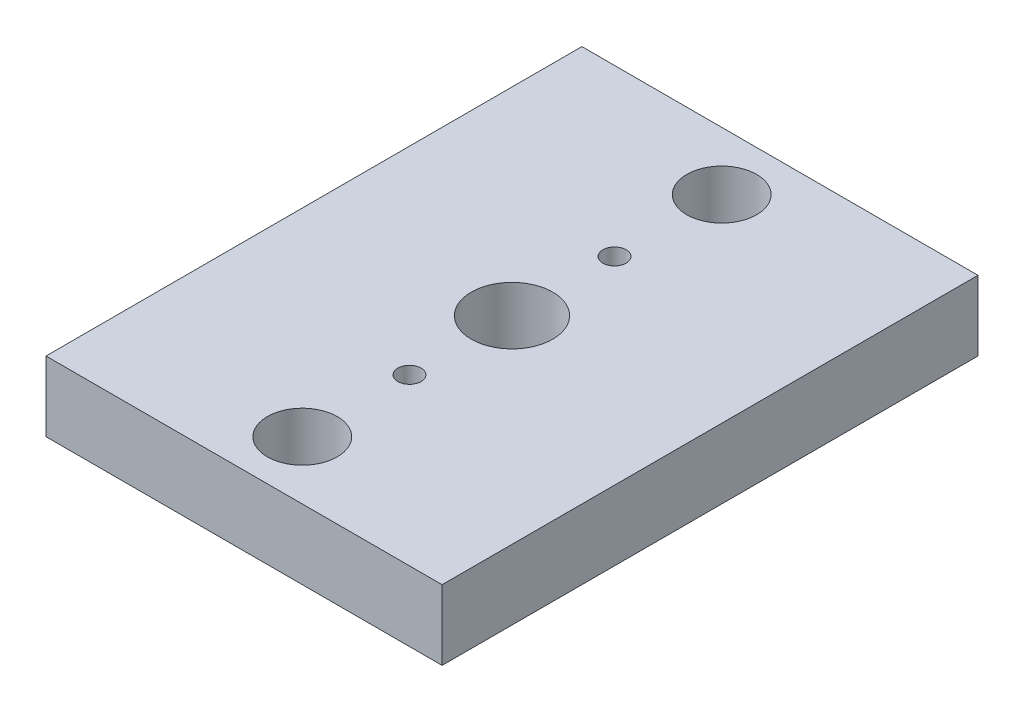
ISO-10303-21;
HEADER;
FILE_DESCRIPTION(('STEP AP214'),'2;1');
FILE_NAME('part.step','',(''),(''),'','','');
FILE_SCHEMA(('AUTOMOTIVE_DESIGN { 1 0 10303 214 1 1 1 1 }'));
ENDSEC;
DATA;
#1=APPLICATION_CONTEXT('core data for automotive mechanical design processes');
#2=APPLICATION_PROTOCOL_DEFINITION('international standard','automotive_design',2000,#1);
#3=PRODUCT_CONTEXT('',#1,'mechanical');
#4=PRODUCT('Part','Part','',(#3));
#5=PRODUCT_RELATED_PRODUCT_CATEGORY('part','',(#4));
#6=PRODUCT_DEFINITION_FORMATION('','',#4);
#7=PRODUCT_DEFINITION_CONTEXT('part definition',#1,'design');
#8=PRODUCT_DEFINITION('design','',#6,#7);
#9=PRODUCT_DEFINITION_SHAPE('','',#8);
#10=(LENGTH_UNIT() NAMED_UNIT(*) SI_UNIT(.MILLI.,.METRE.));
#11=(NAMED_UNIT(*) PLANE_ANGLE_UNIT() SI_UNIT($,.RADIAN.));
#12=(NAMED_UNIT(*) SI_UNIT($,.STERADIAN.) SOLID_ANGLE_UNIT());
#13=UNCERTAINTY_MEASURE_WITH_UNIT(LENGTH_MEASURE(1.E-05),#10,'distance_accuracy_value','');
#14=(GEOMETRIC_REPRESENTATION_CONTEXT(3) GLOBAL_UNCERTAINTY_ASSIGNED_CONTEXT((#13)) GLOBAL_UNIT_ASSIGNED_CONTEXT((#10,
#11,#12)) REPRESENTATION_CONTEXT('',''));
#15=CARTESIAN_POINT('',(0.,0.,0.));
#16=DIRECTION('',(0.,0.,1.));
#17=DIRECTION('',(1.,0.,0.));
#18=AXIS2_PLACEMENT_3D('',#15,#16,#17);
#19=CARTESIAN_POINT('',(-8.5,3.,11.5));
#20=DIRECTION('',(1.,0.,0.));
#21=DIRECTION('',(0.,0.,-1.));
#22=AXIS2_PLACEMENT_3D('',#19,#20,#21);
#23=PLANE('',#22);
#24=DIRECTION('',(0.,0.,1.));
#25=VECTOR('',#24,1.);
#26=CARTESIAN_POINT('',(-8.5,0.,11.5));
#27=LINE('',#26,#25);
#28=CARTESIAN_POINT('',(-8.5,0.,-11.5));
#29=VERTEX_POINT('',#28);
#30=CARTESIAN_POINT('',(-8.5,0.,11.5));
#31=VERTEX_POINT('',#30);
#32=EDGE_CURVE('E96',#29,#31,#27,.T.);
#33=ORIENTED_EDGE('',*,*,#32,.T.);
#34=DIRECTION('',(0.,-1.,0.));
#35=VECTOR('',#34,1.);
#36=CARTESIAN_POINT('',(-8.5,3.,11.5));
#37=LINE('',#36,#35);
#38=CARTESIAN_POINT('',(-8.5,3.,11.5));
#39=VERTEX_POINT('',#38);
#40=EDGE_CURVE('E11',#39,#31,#37,.T.);
#41=ORIENTED_EDGE('',*,*,#40,.F.);
#42=DIRECTION('',(0.,0.,1.));
#43=VECTOR('',#42,1.);
#44=CARTESIAN_POINT('',(-8.5,3.,11.5));
#45=LINE('',#44,#43);
#46=CARTESIAN_POINT('',(-8.5,3.,-11.5));
#47=VERTEX_POINT('',#46);
#48=EDGE_CURVE('E84',#47,#39,#45,.T.);
#49=ORIENTED_EDGE('',*,*,#48,.F.);
#50=DIRECTION('',(0.,-1.,0.));
#51=VECTOR('',#50,1.);
#52=CARTESIAN_POINT('',(-8.5,3.,-11.5));
#53=LINE('',#52,#51);
#54=EDGE_CURVE('E92',#47,#29,#53,.T.);
#55=ORIENTED_EDGE('',*,*,#54,.T.);
#56=EDGE_LOOP('',(#33,#41,#49,#55));
#57=FACE_BOUND('',#56,.T.);
#58=ADVANCED_FACE('F33',(#57),#23,.F.);
#59=CARTESIAN_POINT('',(8.5,3.,11.5));
#60=DIRECTION('',(0.,0.,-1.));
#61=DIRECTION('',(-1.,0.,0.));
#62=AXIS2_PLACEMENT_3D('',#59,#60,#61);
#63=PLANE('',#62);
#64=DIRECTION('',(1.,0.,0.));
#65=VECTOR('',#64,1.);
#66=CARTESIAN_POINT('',(8.5,0.,11.5));
#67=LINE('',#66,#65);
#68=CARTESIAN_POINT('',(8.5,0.,11.5));
#69=VERTEX_POINT('',#68);
#70=EDGE_CURVE('E88',#31,#69,#67,.T.);
#71=ORIENTED_EDGE('',*,*,#70,.T.);
#72=DIRECTION('',(0.,-1.,0.));
#73=VECTOR('',#72,1.);
#74=CARTESIAN_POINT('',(8.5,3.,11.5));
#75=LINE('',#74,#73);
#76=CARTESIAN_POINT('',(8.5,3.,11.5));
#77=VERTEX_POINT('',#76);
#78=EDGE_CURVE('E41',#77,#69,#75,.T.);
#79=ORIENTED_EDGE('',*,*,#78,.F.);
#80=DIRECTION('',(1.,0.,0.));
#81=VECTOR('',#80,1.);
#82=CARTESIAN_POINT('',(8.5,3.,11.5));
#83=LINE('',#82,#81);
#84=EDGE_CURVE('E79',#39,#77,#83,.T.);
#85=ORIENTED_EDGE('',*,*,#84,.F.);
#86=ORIENTED_EDGE('',*,*,#40,.T.);
#87=EDGE_LOOP('',(#71,#79,#85,#86));
#88=FACE_BOUND('',#87,.T.);
#89=ADVANCED_FACE('F87',(#88),#63,.F.);
#90=CARTESIAN_POINT('',(8.5,3.,11.5));
#91=DIRECTION('',(-1.,0.,0.));
#92=DIRECTION('',(0.,0.,1.));
#93=AXIS2_PLACEMENT_3D('',#90,#91,#92);
#94=PLANE('',#93);
#95=DIRECTION('',(0.,0.,-1.));
#96=VECTOR('',#95,1.);
#97=CARTESIAN_POINT('',(8.5,0.,11.5));
#98=LINE('',#97,#96);
#99=CARTESIAN_POINT('',(8.5,0.,-11.5));
#100=VERTEX_POINT('',#99);
#101=EDGE_CURVE('E66',#69,#100,#98,.T.);
#102=ORIENTED_EDGE('',*,*,#101,.T.);
#103=DIRECTION('',(0.,-1.,0.));
#104=VECTOR('',#103,1.);
#105=CARTESIAN_POINT('',(8.5,3.,-11.5));
#106=LINE('',#105,#104);
#107=CARTESIAN_POINT('',(8.5,3.,-11.5));
#108=VERTEX_POINT('',#107);
#109=EDGE_CURVE('E89',#108,#100,#106,.T.);
#110=ORIENTED_EDGE('',*,*,#109,.F.);
#111=DIRECTION('',(0.,0.,-1.));
#112=VECTOR('',#111,1.);
#113=CARTESIAN_POINT('',(8.5,3.,11.5));
#114=LINE('',#113,#112);
#115=EDGE_CURVE('E82',#77,#108,#114,.T.);
#116=ORIENTED_EDGE('',*,*,#115,.F.);
#117=ORIENTED_EDGE('',*,*,#78,.T.);
#118=EDGE_LOOP('',(#102,#110,#116,#117));
#119=FACE_BOUND('',#118,.T.);
#120=ADVANCED_FACE('F90',(#119),#94,.F.);
#121=CARTESIAN_POINT('',(8.5,3.,-11.5));
#122=DIRECTION('',(0.,0.,1.));
#123=DIRECTION('',(1.,0.,0.));
#124=AXIS2_PLACEMENT_3D('',#121,#122,#123);
#125=PLANE('',#124);
#126=DIRECTION('',(-1.,0.,0.));
#127=VECTOR('',#126,1.);
#128=CARTESIAN_POINT('',(8.5,0.,-11.5));
#129=LINE('',#128,#127);
#130=EDGE_CURVE('E72',#100,#29,#129,.T.);
#131=ORIENTED_EDGE('',*,*,#130,.T.);
#132=ORIENTED_EDGE('',*,*,#54,.F.);
#133=DIRECTION('',(-1.,0.,0.));
#134=VECTOR('',#133,1.);
#135=CARTESIAN_POINT('',(8.5,3.,-11.5));
#136=LINE('',#135,#134);
#137=EDGE_CURVE('E49',#108,#47,#136,.T.);
#138=ORIENTED_EDGE('',*,*,#137,.F.);
#139=ORIENTED_EDGE('',*,*,#109,.T.);
#140=EDGE_LOOP('',(#131,#132,#138,#139));
#141=FACE_BOUND('',#140,.T.);
#142=ADVANCED_FACE('F104',(#141),#125,.F.);
#143=CARTESIAN_POINT('',(0.,3.,0.));
#144=DIRECTION('',(0.,1.,0.));
#145=DIRECTION('',(0.,0.,1.));
#146=AXIS2_PLACEMENT_3D('',#143,#144,#145);
#147=PLANE('',#146);
#148=CARTESIAN_POINT('',(0.,3.,0.));
#149=DIRECTION('',(0.,1.,0.));
#150=DIRECTION('',(0.,0.,1.));
#151=AXIS2_PLACEMENT_3D('',#148,#149,#150);
#152=CIRCLE('',#151,1.75);
#153=CARTESIAN_POINT('',(0.,3.,1.75));
#154=VERTEX_POINT('',#153);
#155=EDGE_CURVE('E134',#154,#154,#152,.T.);
#156=ORIENTED_EDGE('',*,*,#155,.F.);
#157=EDGE_LOOP('',(#156));
#158=FACE_BOUND('',#157,.T.);
#159=CARTESIAN_POINT('',(0.,3.,-9.));
#160=DIRECTION('',(0.,1.,0.));
#161=DIRECTION('',(0.,0.,1.));
#162=AXIS2_PLACEMENT_3D('',#159,#160,#161);
#163=CIRCLE('',#162,1.5);
#164=CARTESIAN_POINT('',(0.,3.,-7.5));
#165=VERTEX_POINT('',#164);
#166=EDGE_CURVE('E129',#165,#165,#163,.T.);
#167=ORIENTED_EDGE('',*,*,#166,.F.);
#168=EDGE_LOOP('',(#167));
#169=FACE_BOUND('',#168,.T.);
#170=CARTESIAN_POINT('',(0.,3.,-4.4));
#171=DIRECTION('',(0.,1.,0.));
#172=DIRECTION('',(0.,0.,1.));
#173=AXIS2_PLACEMENT_3D('',#170,#171,#172);
#174=CIRCLE('',#173,0.5);
#175=CARTESIAN_POINT('',(0.,3.,-3.9));
#176=VERTEX_POINT('',#175);
#177=EDGE_CURVE('E123',#176,#176,#174,.T.);
#178=ORIENTED_EDGE('',*,*,#177,.F.);
#179=EDGE_LOOP('',(#178));
#180=FACE_BOUND('',#179,.T.);
#181=CARTESIAN_POINT('',(0.,3.,4.4));
#182=DIRECTION('',(0.,1.,0.));
#183=DIRECTION('',(0.,0.,-1.));
#184=AXIS2_PLACEMENT_3D('',#181,#182,#183);
#185=CIRCLE('',#184,0.5);
#186=CARTESIAN_POINT('',(0.,3.,3.9));
#187=VERTEX_POINT('',#186);
#188=EDGE_CURVE('E117',#187,#187,#185,.T.);
#189=ORIENTED_EDGE('',*,*,#188,.F.);
#190=EDGE_LOOP('',(#189));
#191=FACE_BOUND('',#190,.T.);
#192=CARTESIAN_POINT('',(0.,3.,9.));
#193=DIRECTION('',(0.,1.,0.));
#194=DIRECTION('',(0.,0.,-1.));
#195=AXIS2_PLACEMENT_3D('',#192,#193,#194);
#196=CIRCLE('',#195,1.5);
#197=CARTESIAN_POINT('',(0.,3.,7.5));
#198=VERTEX_POINT('',#197);
#199=EDGE_CURVE('E110',#198,#198,#196,.T.);
#200=ORIENTED_EDGE('',*,*,#199,.F.);
#201=EDGE_LOOP('',(#200));
#202=FACE_BOUND('',#201,.T.);
#203=ORIENTED_EDGE('',*,*,#48,.T.);
#204=ORIENTED_EDGE('',*,*,#84,.T.);
#205=ORIENTED_EDGE('',*,*,#115,.T.);
#206=ORIENTED_EDGE('',*,*,#137,.T.);
#207=EDGE_LOOP('',(#203,#204,#205,#206));
#208=FACE_BOUND('',#207,.T.);
#209=ADVANCED_FACE('F80',(#158,#169,#180,#191,#202,#208),#147,.T.);
#210=CARTESIAN_POINT('',(0.,0.,0.));
#211=DIRECTION('',(0.,1.,0.));
#212=DIRECTION('',(0.,0.,1.));
#213=AXIS2_PLACEMENT_3D('',#210,#211,#212);
#214=PLANE('',#213);
#215=CARTESIAN_POINT('',(0.,0.,0.));
#216=DIRECTION('',(0.,1.,0.));
#217=DIRECTION('',(0.,0.,1.));
#218=AXIS2_PLACEMENT_3D('',#215,#216,#217);
#219=CIRCLE('',#218,1.75);
#220=CARTESIAN_POINT('',(0.,0.,1.75));
#221=VERTEX_POINT('',#220);
#222=EDGE_CURVE('E114',#221,#221,#219,.T.);
#223=ORIENTED_EDGE('',*,*,#222,.T.);
#224=EDGE_LOOP('',(#223));
#225=FACE_BOUND('',#224,.T.);
#226=CARTESIAN_POINT('',(0.,0.,-9.));
#227=DIRECTION('',(0.,1.,0.));
#228=DIRECTION('',(0.,0.,1.));
#229=AXIS2_PLACEMENT_3D('',#226,#227,#228);
#230=CIRCLE('',#229,1.5);
#231=CARTESIAN_POINT('',(0.,0.,-7.5));
#232=VERTEX_POINT('',#231);
#233=EDGE_CURVE('E99',#232,#232,#230,.T.);
#234=ORIENTED_EDGE('',*,*,#233,.T.);
#235=EDGE_LOOP('',(#234));
#236=FACE_BOUND('',#235,.T.);
#237=CARTESIAN_POINT('',(0.,0.,-4.4));
#238=DIRECTION('',(0.,1.,0.));
#239=DIRECTION('',(0.,0.,1.));
#240=AXIS2_PLACEMENT_3D('',#237,#238,#239);
#241=CIRCLE('',#240,0.5);
#242=CARTESIAN_POINT('',(0.,0.,-3.9));
#243=VERTEX_POINT('',#242);
#244=EDGE_CURVE('E126',#243,#243,#241,.T.);
#245=ORIENTED_EDGE('',*,*,#244,.T.);
#246=EDGE_LOOP('',(#245));
#247=FACE_BOUND('',#246,.T.);
#248=CARTESIAN_POINT('',(0.,0.,4.4));
#249=DIRECTION('',(0.,1.,0.));
#250=DIRECTION('',(0.,0.,-1.));
#251=AXIS2_PLACEMENT_3D('',#248,#249,#250);
#252=CIRCLE('',#251,0.5);
#253=CARTESIAN_POINT('',(0.,0.,3.9));
#254=VERTEX_POINT('',#253);
#255=EDGE_CURVE('E120',#254,#254,#252,.T.);
#256=ORIENTED_EDGE('',*,*,#255,.T.);
#257=EDGE_LOOP('',(#256));
#258=FACE_BOUND('',#257,.T.);
#259=CARTESIAN_POINT('',(0.,0.,9.));
#260=DIRECTION('',(0.,1.,0.));
#261=DIRECTION('',(0.,0.,-1.));
#262=AXIS2_PLACEMENT_3D('',#259,#260,#261);
#263=CIRCLE('',#262,1.5);
#264=CARTESIAN_POINT('',(0.,0.,7.5));
#265=VERTEX_POINT('',#264);
#266=EDGE_CURVE('E113',#265,#265,#263,.T.);
#267=ORIENTED_EDGE('',*,*,#266,.T.);
#268=EDGE_LOOP('',(#267));
#269=FACE_BOUND('',#268,.T.);
#270=ORIENTED_EDGE('',*,*,#32,.F.);
#271=ORIENTED_EDGE('',*,*,#130,.F.);
#272=ORIENTED_EDGE('',*,*,#101,.F.);
#273=ORIENTED_EDGE('',*,*,#70,.F.);
#274=EDGE_LOOP('',(#270,#271,#272,#273));
#275=FACE_BOUND('',#274,.T.);
#276=ADVANCED_FACE('F107',(#225,#236,#247,#258,#269,#275),#214,.F.);
#277=CARTESIAN_POINT('',(0.,0.,9.));
#278=DIRECTION('',(0.,1.,0.));
#279=DIRECTION('',(0.,0.,1.));
#280=AXIS2_PLACEMENT_3D('',#277,#278,#279);
#281=CYLINDRICAL_SURFACE('',#280,1.5);
#282=ORIENTED_EDGE('',*,*,#266,.F.);
#283=EDGE_LOOP('',(#282));
#284=FACE_BOUND('',#283,.T.);
#285=ORIENTED_EDGE('',*,*,#199,.T.);
#286=EDGE_LOOP('',(#285));
#287=FACE_BOUND('',#286,.T.);
#288=ADVANCED_FACE('F160',(#284,#287),#281,.F.);
#289=CARTESIAN_POINT('',(0.,0.,4.4));
#290=DIRECTION('',(0.,1.,0.));
#291=DIRECTION('',(0.,0.,1.));
#292=AXIS2_PLACEMENT_3D('',#289,#290,#291);
#293=CYLINDRICAL_SURFACE('',#292,0.5);
#294=ORIENTED_EDGE('',*,*,#255,.F.);
#295=EDGE_LOOP('',(#294));
#296=FACE_BOUND('',#295,.T.);
#297=ORIENTED_EDGE('',*,*,#188,.T.);
#298=EDGE_LOOP('',(#297));
#299=FACE_BOUND('',#298,.T.);
#300=ADVANCED_FACE('F162',(#296,#299),#293,.F.);
#301=CARTESIAN_POINT('',(0.,0.,-4.4));
#302=DIRECTION('',(0.,1.,0.));
#303=DIRECTION('',(0.,0.,1.));
#304=AXIS2_PLACEMENT_3D('',#301,#302,#303);
#305=CYLINDRICAL_SURFACE('',#304,0.5);
#306=ORIENTED_EDGE('',*,*,#244,.F.);
#307=EDGE_LOOP('',(#306));
#308=FACE_BOUND('',#307,.T.);
#309=ORIENTED_EDGE('',*,*,#177,.T.);
#310=EDGE_LOOP('',(#309));
#311=FACE_BOUND('',#310,.T.);
#312=ADVANCED_FACE('F169',(#308,#311),#305,.F.);
#313=CARTESIAN_POINT('',(0.,0.,-9.));
#314=DIRECTION('',(0.,1.,0.));
#315=DIRECTION('',(0.,0.,1.));
#316=AXIS2_PLACEMENT_3D('',#313,#314,#315);
#317=CYLINDRICAL_SURFACE('',#316,1.5);
#318=ORIENTED_EDGE('',*,*,#233,.F.);
#319=EDGE_LOOP('',(#318));
#320=FACE_BOUND('',#319,.T.);
#321=ORIENTED_EDGE('',*,*,#166,.T.);
#322=EDGE_LOOP('',(#321));
#323=FACE_BOUND('',#322,.T.);
#324=ADVANCED_FACE('F145',(#320,#323),#317,.F.);
#325=CARTESIAN_POINT('',(0.,0.,0.));
#326=DIRECTION('',(0.,1.,0.));
#327=DIRECTION('',(0.,0.,1.));
#328=AXIS2_PLACEMENT_3D('',#325,#326,#327);
#329=CYLINDRICAL_SURFACE('',#328,1.75);
#330=ORIENTED_EDGE('',*,*,#222,.F.);
#331=EDGE_LOOP('',(#330));
#332=FACE_BOUND('',#331,.T.);
#333=ORIENTED_EDGE('',*,*,#155,.T.);
#334=EDGE_LOOP('',(#333));
#335=FACE_BOUND('',#334,.T.);
#336=ADVANCED_FACE('F142',(#332,#335),#329,.F.);
#337=CLOSED_SHELL('',(#58,#89,#120,#142,#209,#276,#288,#300,#312,#324,#336));
#338=MANIFOLD_SOLID_BREP('B2',#337);
#339=ADVANCED_BREP_SHAPE_REPRESENTATION('',(#18,#338),#14);
#340=SHAPE_DEFINITION_REPRESENTATION(#9,#339);
ENDSEC;
END-ISO-10303-21;
